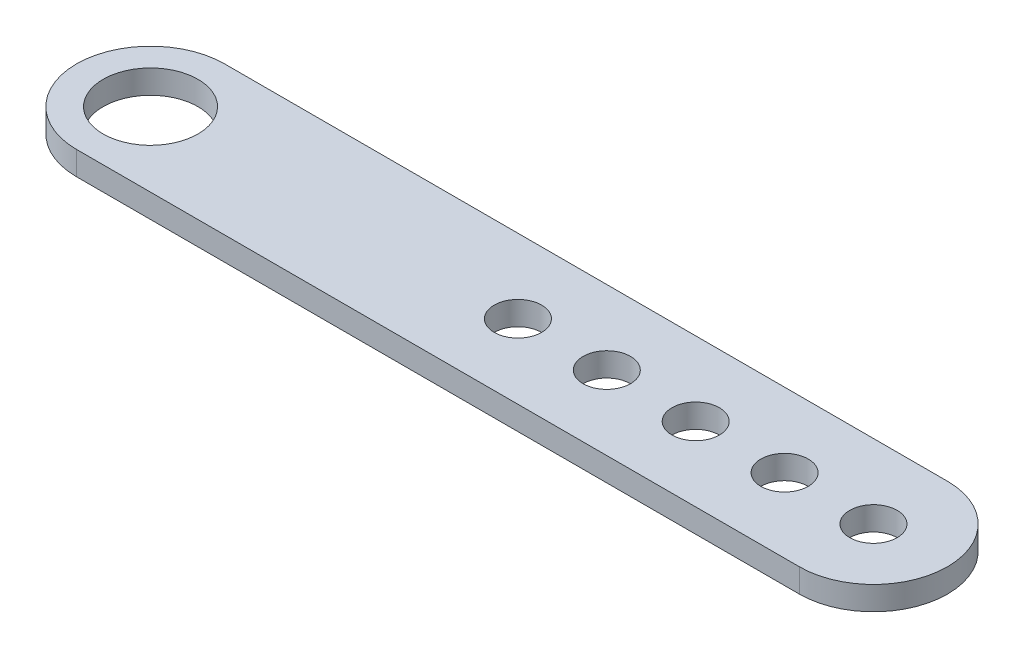
ISO-10303-21;
HEADER;
FILE_DESCRIPTION(('STEP AP214'),'2;1');
FILE_NAME('part.step','',(''),(''),'','','');
FILE_SCHEMA(('AUTOMOTIVE_DESIGN { 1 0 10303 214 1 1 1 1 }'));
ENDSEC;
DATA;
#1=APPLICATION_CONTEXT('core data for automotive mechanical design processes');
#2=APPLICATION_PROTOCOL_DEFINITION('international standard','automotive_design',2000,#1);
#3=PRODUCT_CONTEXT('',#1,'mechanical');
#4=PRODUCT('Part','Part','',(#3));
#5=PRODUCT_RELATED_PRODUCT_CATEGORY('part','',(#4));
#6=PRODUCT_DEFINITION_FORMATION('','',#4);
#7=PRODUCT_DEFINITION_CONTEXT('part definition',#1,'design');
#8=PRODUCT_DEFINITION('design','',#6,#7);
#9=PRODUCT_DEFINITION_SHAPE('','',#8);
#10=(LENGTH_UNIT() NAMED_UNIT(*) SI_UNIT(.MILLI.,.METRE.));
#11=(NAMED_UNIT(*) PLANE_ANGLE_UNIT() SI_UNIT($,.RADIAN.));
#12=(NAMED_UNIT(*) SI_UNIT($,.STERADIAN.) SOLID_ANGLE_UNIT());
#13=UNCERTAINTY_MEASURE_WITH_UNIT(LENGTH_MEASURE(1.E-05),#10,'distance_accuracy_value','');
#14=(GEOMETRIC_REPRESENTATION_CONTEXT(3) GLOBAL_UNCERTAINTY_ASSIGNED_CONTEXT((#13)) GLOBAL_UNIT_ASSIGNED_CONTEXT((#10,
#11,#12)) REPRESENTATION_CONTEXT('',''));
#15=CARTESIAN_POINT('',(0.,0.,0.));
#16=DIRECTION('',(0.,0.,1.));
#17=DIRECTION('',(1.,0.,0.));
#18=AXIS2_PLACEMENT_3D('',#15,#16,#17);
#19=CARTESIAN_POINT('',(-61.,2.,0.));
#20=DIRECTION('',(0.,1.,0.));
#21=DIRECTION('',(0.,0.,1.));
#22=AXIS2_PLACEMENT_3D('',#19,#20,#21);
#23=PLANE('',#22);
#24=CARTESIAN_POINT('',(46.,2.,0.));
#25=DIRECTION('',(0.,1.,0.));
#26=DIRECTION('',(0.,0.,1.));
#27=AXIS2_PLACEMENT_3D('',#24,#25,#26);
#28=CIRCLE('',#27,4.);
#29=CARTESIAN_POINT('',(46.,2.,4.));
#30=VERTEX_POINT('',#29);
#31=EDGE_CURVE('E139',#30,#30,#28,.T.);
#32=ORIENTED_EDGE('',*,*,#31,.F.);
#33=EDGE_LOOP('',(#32));
#34=FACE_BOUND('',#33,.T.);
#35=CARTESIAN_POINT('',(16.,2.,0.));
#36=DIRECTION('',(0.,1.,0.));
#37=DIRECTION('',(0.,0.,1.));
#38=AXIS2_PLACEMENT_3D('',#35,#36,#37);
#39=CIRCLE('',#38,4.);
#40=CARTESIAN_POINT('',(16.,2.,4.));
#41=VERTEX_POINT('',#40);
#42=EDGE_CURVE('E127',#41,#41,#39,.T.);
#43=ORIENTED_EDGE('',*,*,#42,.F.);
#44=EDGE_LOOP('',(#43));
#45=FACE_BOUND('',#44,.T.);
#46=CARTESIAN_POINT('',(-61.,2.,0.));
#47=DIRECTION('',(0.,1.,0.));
#48=DIRECTION('',(0.,0.,1.));
#49=AXIS2_PLACEMENT_3D('',#46,#47,#48);
#50=CIRCLE('',#49,8.);
#51=CARTESIAN_POINT('',(-61.,2.,8.));
#52=VERTEX_POINT('',#51);
#53=EDGE_CURVE('E106',#52,#52,#50,.T.);
#54=ORIENTED_EDGE('',*,*,#53,.F.);
#55=EDGE_LOOP('',(#54));
#56=FACE_BOUND('',#55,.T.);
#57=CARTESIAN_POINT('',(-61.,2.,0.));
#58=DIRECTION('',(0.,1.,0.));
#59=DIRECTION('',(0.,0.,1.));
#60=AXIS2_PLACEMENT_3D('',#57,#58,#59);
#61=CIRCLE('',#60,12.5);
#62=CARTESIAN_POINT('',(-61.,2.,-12.5));
#63=VERTEX_POINT('',#62);
#64=CARTESIAN_POINT('',(-61.,2.,12.5));
#65=VERTEX_POINT('',#64);
#66=EDGE_CURVE('E91',#63,#65,#61,.T.);
#67=ORIENTED_EDGE('',*,*,#66,.T.);
#68=DIRECTION('',(1.,0.,0.));
#69=VECTOR('',#68,1.);
#70=CARTESIAN_POINT('',(-61.,2.,12.5));
#71=LINE('',#70,#69);
#72=CARTESIAN_POINT('',(61.,2.,12.5));
#73=VERTEX_POINT('',#72);
#74=EDGE_CURVE('E86',#65,#73,#71,.T.);
#75=ORIENTED_EDGE('',*,*,#74,.T.);
#76=CARTESIAN_POINT('',(61.,2.,0.));
#77=DIRECTION('',(0.,1.,0.));
#78=DIRECTION('',(0.,0.,1.));
#79=AXIS2_PLACEMENT_3D('',#76,#77,#78);
#80=CIRCLE('',#79,12.5);
#81=CARTESIAN_POINT('',(61.,2.,-12.5));
#82=VERTEX_POINT('',#81);
#83=EDGE_CURVE('E89',#73,#82,#80,.T.);
#84=ORIENTED_EDGE('',*,*,#83,.T.);
#85=DIRECTION('',(-1.,0.,0.));
#86=VECTOR('',#85,1.);
#87=CARTESIAN_POINT('',(-61.,2.,-12.5));
#88=LINE('',#87,#86);
#89=EDGE_CURVE('E56',#82,#63,#88,.T.);
#90=ORIENTED_EDGE('',*,*,#89,.T.);
#91=EDGE_LOOP('',(#67,#75,#84,#90));
#92=FACE_BOUND('',#91,.T.);
#93=CARTESIAN_POINT('',(1.,2.,0.));
#94=DIRECTION('',(0.,1.,0.));
#95=DIRECTION('',(0.,0.,1.));
#96=AXIS2_PLACEMENT_3D('',#93,#94,#95);
#97=CIRCLE('',#96,4.);
#98=CARTESIAN_POINT('',(1.,2.,4.));
#99=VERTEX_POINT('',#98);
#100=EDGE_CURVE('E121',#99,#99,#97,.T.);
#101=ORIENTED_EDGE('',*,*,#100,.F.);
#102=EDGE_LOOP('',(#101));
#103=FACE_BOUND('',#102,.T.);
#104=CARTESIAN_POINT('',(31.,2.,0.));
#105=DIRECTION('',(0.,1.,0.));
#106=DIRECTION('',(0.,0.,1.));
#107=AXIS2_PLACEMENT_3D('',#104,#105,#106);
#108=CIRCLE('',#107,4.);
#109=CARTESIAN_POINT('',(31.,2.,4.));
#110=VERTEX_POINT('',#109);
#111=EDGE_CURVE('E133',#110,#110,#108,.T.);
#112=ORIENTED_EDGE('',*,*,#111,.F.);
#113=EDGE_LOOP('',(#112));
#114=FACE_BOUND('',#113,.T.);
#115=CARTESIAN_POINT('',(61.,2.,0.));
#116=DIRECTION('',(0.,1.,0.));
#117=DIRECTION('',(0.,0.,1.));
#118=AXIS2_PLACEMENT_3D('',#115,#116,#117);
#119=CIRCLE('',#118,4.00000000000001);
#120=CARTESIAN_POINT('',(61.,2.,4.00000000000001));
#121=VERTEX_POINT('',#120);
#122=EDGE_CURVE('E145',#121,#121,#119,.T.);
#123=ORIENTED_EDGE('',*,*,#122,.F.);
#124=EDGE_LOOP('',(#123));
#125=FACE_BOUND('',#124,.T.);
#126=ADVANCED_FACE('F39',(#34,#45,#56,#92,#103,#114,#125),#23,.T.);
#127=CARTESIAN_POINT('',(-61.,-2.,0.));
#128=DIRECTION('',(0.,1.,0.));
#129=DIRECTION('',(0.,0.,1.));
#130=AXIS2_PLACEMENT_3D('',#127,#128,#129);
#131=PLANE('',#130);
#132=CARTESIAN_POINT('',(-61.,-2.,0.));
#133=DIRECTION('',(0.,1.,0.));
#134=DIRECTION('',(0.,0.,1.));
#135=AXIS2_PLACEMENT_3D('',#132,#133,#134);
#136=CIRCLE('',#135,12.5);
#137=CARTESIAN_POINT('',(-61.,-2.,-12.5));
#138=VERTEX_POINT('',#137);
#139=CARTESIAN_POINT('',(-61.,-2.,12.5));
#140=VERTEX_POINT('',#139);
#141=EDGE_CURVE('E103',#138,#140,#136,.T.);
#142=ORIENTED_EDGE('',*,*,#141,.F.);
#143=DIRECTION('',(-1.,0.,0.));
#144=VECTOR('',#143,1.);
#145=CARTESIAN_POINT('',(-61.,-2.,-12.5));
#146=LINE('',#145,#144);
#147=CARTESIAN_POINT('',(61.,-2.,-12.5));
#148=VERTEX_POINT('',#147);
#149=EDGE_CURVE('E79',#148,#138,#146,.T.);
#150=ORIENTED_EDGE('',*,*,#149,.F.);
#151=CARTESIAN_POINT('',(61.,-2.,0.));
#152=DIRECTION('',(0.,1.,0.));
#153=DIRECTION('',(0.,0.,1.));
#154=AXIS2_PLACEMENT_3D('',#151,#152,#153);
#155=CIRCLE('',#154,12.5);
#156=CARTESIAN_POINT('',(61.,-2.,12.5));
#157=VERTEX_POINT('',#156);
#158=EDGE_CURVE('E73',#157,#148,#155,.T.);
#159=ORIENTED_EDGE('',*,*,#158,.F.);
#160=DIRECTION('',(1.,0.,0.));
#161=VECTOR('',#160,1.);
#162=CARTESIAN_POINT('',(-61.,-2.,12.5));
#163=LINE('',#162,#161);
#164=EDGE_CURVE('E95',#140,#157,#163,.T.);
#165=ORIENTED_EDGE('',*,*,#164,.F.);
#166=EDGE_LOOP('',(#142,#150,#159,#165));
#167=FACE_BOUND('',#166,.T.);
#168=CARTESIAN_POINT('',(-61.,-2.,0.));
#169=DIRECTION('',(0.,1.,0.));
#170=DIRECTION('',(0.,0.,1.));
#171=AXIS2_PLACEMENT_3D('',#168,#169,#170);
#172=CIRCLE('',#171,8.);
#173=CARTESIAN_POINT('',(-61.,-2.,8.));
#174=VERTEX_POINT('',#173);
#175=EDGE_CURVE('E118',#174,#174,#172,.T.);
#176=ORIENTED_EDGE('',*,*,#175,.T.);
#177=EDGE_LOOP('',(#176));
#178=FACE_BOUND('',#177,.T.);
#179=CARTESIAN_POINT('',(1.,-2.,0.));
#180=DIRECTION('',(0.,1.,0.));
#181=DIRECTION('',(0.,0.,1.));
#182=AXIS2_PLACEMENT_3D('',#179,#180,#181);
#183=CIRCLE('',#182,4.);
#184=CARTESIAN_POINT('',(1.,-2.,4.));
#185=VERTEX_POINT('',#184);
#186=EDGE_CURVE('E124',#185,#185,#183,.T.);
#187=ORIENTED_EDGE('',*,*,#186,.T.);
#188=EDGE_LOOP('',(#187));
#189=FACE_BOUND('',#188,.T.);
#190=CARTESIAN_POINT('',(16.,-2.,0.));
#191=DIRECTION('',(0.,1.,0.));
#192=DIRECTION('',(0.,0.,1.));
#193=AXIS2_PLACEMENT_3D('',#190,#191,#192);
#194=CIRCLE('',#193,4.);
#195=CARTESIAN_POINT('',(16.,-2.,4.));
#196=VERTEX_POINT('',#195);
#197=EDGE_CURVE('E130',#196,#196,#194,.T.);
#198=ORIENTED_EDGE('',*,*,#197,.T.);
#199=EDGE_LOOP('',(#198));
#200=FACE_BOUND('',#199,.T.);
#201=CARTESIAN_POINT('',(31.,-2.,0.));
#202=DIRECTION('',(0.,1.,0.));
#203=DIRECTION('',(0.,0.,1.));
#204=AXIS2_PLACEMENT_3D('',#201,#202,#203);
#205=CIRCLE('',#204,4.);
#206=CARTESIAN_POINT('',(31.,-2.,4.));
#207=VERTEX_POINT('',#206);
#208=EDGE_CURVE('E136',#207,#207,#205,.T.);
#209=ORIENTED_EDGE('',*,*,#208,.T.);
#210=EDGE_LOOP('',(#209));
#211=FACE_BOUND('',#210,.T.);
#212=CARTESIAN_POINT('',(46.,-2.,0.));
#213=DIRECTION('',(0.,1.,0.));
#214=DIRECTION('',(0.,0.,1.));
#215=AXIS2_PLACEMENT_3D('',#212,#213,#214);
#216=CIRCLE('',#215,4.);
#217=CARTESIAN_POINT('',(46.,-2.,4.));
#218=VERTEX_POINT('',#217);
#219=EDGE_CURVE('E142',#218,#218,#216,.T.);
#220=ORIENTED_EDGE('',*,*,#219,.T.);
#221=EDGE_LOOP('',(#220));
#222=FACE_BOUND('',#221,.T.);
#223=CARTESIAN_POINT('',(61.,-2.,0.));
#224=DIRECTION('',(0.,1.,0.));
#225=DIRECTION('',(0.,0.,1.));
#226=AXIS2_PLACEMENT_3D('',#223,#224,#225);
#227=CIRCLE('',#226,4.00000000000001);
#228=CARTESIAN_POINT('',(61.,-2.,4.00000000000001));
#229=VERTEX_POINT('',#228);
#230=EDGE_CURVE('E148',#229,#229,#227,.T.);
#231=ORIENTED_EDGE('',*,*,#230,.T.);
#232=EDGE_LOOP('',(#231));
#233=FACE_BOUND('',#232,.T.);
#234=ADVANCED_FACE('F114',(#167,#178,#189,#200,#211,#222,#233),#131,.F.);
#235=CARTESIAN_POINT('',(-61.,2.,0.));
#236=DIRECTION('',(0.,-1.,0.));
#237=DIRECTION('',(0.,0.,-1.));
#238=AXIS2_PLACEMENT_3D('',#235,#236,#237);
#239=CYLINDRICAL_SURFACE('',#238,12.5);
#240=ORIENTED_EDGE('',*,*,#141,.T.);
#241=DIRECTION('',(0.,-1.,0.));
#242=VECTOR('',#241,1.);
#243=CARTESIAN_POINT('',(-61.,2.,12.5));
#244=LINE('',#243,#242);
#245=EDGE_CURVE('E11',#65,#140,#244,.T.);
#246=ORIENTED_EDGE('',*,*,#245,.F.);
#247=ORIENTED_EDGE('',*,*,#66,.F.);
#248=DIRECTION('',(0.,-1.,0.));
#249=VECTOR('',#248,1.);
#250=CARTESIAN_POINT('',(-61.,2.,-12.5));
#251=LINE('',#250,#249);
#252=EDGE_CURVE('E99',#63,#138,#251,.T.);
#253=ORIENTED_EDGE('',*,*,#252,.T.);
#254=EDGE_LOOP('',(#240,#246,#247,#253));
#255=FACE_BOUND('',#254,.T.);
#256=ADVANCED_FACE('F41',(#255),#239,.T.);
#257=CARTESIAN_POINT('',(-61.,2.,12.5));
#258=DIRECTION('',(0.,0.,-1.));
#259=DIRECTION('',(-1.,0.,0.));
#260=AXIS2_PLACEMENT_3D('',#257,#258,#259);
#261=PLANE('',#260);
#262=ORIENTED_EDGE('',*,*,#164,.T.);
#263=DIRECTION('',(0.,-1.,0.));
#264=VECTOR('',#263,1.);
#265=CARTESIAN_POINT('',(61.,2.,12.5));
#266=LINE('',#265,#264);
#267=EDGE_CURVE('E48',#73,#157,#266,.T.);
#268=ORIENTED_EDGE('',*,*,#267,.F.);
#269=ORIENTED_EDGE('',*,*,#74,.F.);
#270=ORIENTED_EDGE('',*,*,#245,.T.);
#271=EDGE_LOOP('',(#262,#268,#269,#270));
#272=FACE_BOUND('',#271,.T.);
#273=ADVANCED_FACE('F94',(#272),#261,.F.);
#274=CARTESIAN_POINT('',(61.,2.,0.));
#275=DIRECTION('',(0.,-1.,0.));
#276=DIRECTION('',(0.,0.,-1.));
#277=AXIS2_PLACEMENT_3D('',#274,#275,#276);
#278=CYLINDRICAL_SURFACE('',#277,12.5);
#279=ORIENTED_EDGE('',*,*,#158,.T.);
#280=DIRECTION('',(0.,-1.,0.));
#281=VECTOR('',#280,1.);
#282=CARTESIAN_POINT('',(61.,2.,-12.5));
#283=LINE('',#282,#281);
#284=EDGE_CURVE('E96',#82,#148,#283,.T.);
#285=ORIENTED_EDGE('',*,*,#284,.F.);
#286=ORIENTED_EDGE('',*,*,#83,.F.);
#287=ORIENTED_EDGE('',*,*,#267,.T.);
#288=EDGE_LOOP('',(#279,#285,#286,#287));
#289=FACE_BOUND('',#288,.T.);
#290=ADVANCED_FACE('F97',(#289),#278,.T.);
#291=CARTESIAN_POINT('',(-61.,2.,-12.5));
#292=DIRECTION('',(0.,0.,1.));
#293=DIRECTION('',(1.,0.,0.));
#294=AXIS2_PLACEMENT_3D('',#291,#292,#293);
#295=PLANE('',#294);
#296=ORIENTED_EDGE('',*,*,#149,.T.);
#297=ORIENTED_EDGE('',*,*,#252,.F.);
#298=ORIENTED_EDGE('',*,*,#89,.F.);
#299=ORIENTED_EDGE('',*,*,#284,.T.);
#300=EDGE_LOOP('',(#296,#297,#298,#299));
#301=FACE_BOUND('',#300,.T.);
#302=ADVANCED_FACE('F111',(#301),#295,.F.);
#303=CARTESIAN_POINT('',(-61.,2.,0.));
#304=DIRECTION('',(0.,-1.,0.));
#305=DIRECTION('',(0.,0.,-1.));
#306=AXIS2_PLACEMENT_3D('',#303,#304,#305);
#307=CYLINDRICAL_SURFACE('',#306,8.);
#308=ORIENTED_EDGE('',*,*,#53,.T.);
#309=EDGE_LOOP('',(#308));
#310=FACE_BOUND('',#309,.T.);
#311=ORIENTED_EDGE('',*,*,#175,.F.);
#312=EDGE_LOOP('',(#311));
#313=FACE_BOUND('',#312,.T.);
#314=ADVANCED_FACE('F167',(#310,#313),#307,.F.);
#315=CARTESIAN_POINT('',(1.,2.,0.));
#316=DIRECTION('',(0.,-1.,0.));
#317=DIRECTION('',(0.,0.,-1.));
#318=AXIS2_PLACEMENT_3D('',#315,#316,#317);
#319=CYLINDRICAL_SURFACE('',#318,4.);
#320=ORIENTED_EDGE('',*,*,#100,.T.);
#321=EDGE_LOOP('',(#320));
#322=FACE_BOUND('',#321,.T.);
#323=ORIENTED_EDGE('',*,*,#186,.F.);
#324=EDGE_LOOP('',(#323));
#325=FACE_BOUND('',#324,.T.);
#326=ADVANCED_FACE('F202',(#322,#325),#319,.F.);
#327=CARTESIAN_POINT('',(16.,2.,0.));
#328=DIRECTION('',(0.,-1.,0.));
#329=DIRECTION('',(0.,0.,-1.));
#330=AXIS2_PLACEMENT_3D('',#327,#328,#329);
#331=CYLINDRICAL_SURFACE('',#330,4.);
#332=ORIENTED_EDGE('',*,*,#42,.T.);
#333=EDGE_LOOP('',(#332));
#334=FACE_BOUND('',#333,.T.);
#335=ORIENTED_EDGE('',*,*,#197,.F.);
#336=EDGE_LOOP('',(#335));
#337=FACE_BOUND('',#336,.T.);
#338=ADVANCED_FACE('F209',(#334,#337),#331,.F.);
#339=CARTESIAN_POINT('',(31.,2.,0.));
#340=DIRECTION('',(0.,-1.,0.));
#341=DIRECTION('',(0.,0.,-1.));
#342=AXIS2_PLACEMENT_3D('',#339,#340,#341);
#343=CYLINDRICAL_SURFACE('',#342,4.);
#344=ORIENTED_EDGE('',*,*,#111,.T.);
#345=EDGE_LOOP('',(#344));
#346=FACE_BOUND('',#345,.T.);
#347=ORIENTED_EDGE('',*,*,#208,.F.);
#348=EDGE_LOOP('',(#347));
#349=FACE_BOUND('',#348,.T.);
#350=ADVANCED_FACE('F216',(#346,#349),#343,.F.);
#351=CARTESIAN_POINT('',(46.,2.,0.));
#352=DIRECTION('',(0.,-1.,0.));
#353=DIRECTION('',(0.,0.,-1.));
#354=AXIS2_PLACEMENT_3D('',#351,#352,#353);
#355=CYLINDRICAL_SURFACE('',#354,4.);
#356=ORIENTED_EDGE('',*,*,#31,.T.);
#357=EDGE_LOOP('',(#356));
#358=FACE_BOUND('',#357,.T.);
#359=ORIENTED_EDGE('',*,*,#219,.F.);
#360=EDGE_LOOP('',(#359));
#361=FACE_BOUND('',#360,.T.);
#362=ADVANCED_FACE('F224',(#358,#361),#355,.F.);
#363=CARTESIAN_POINT('',(61.,2.,0.));
#364=DIRECTION('',(0.,-1.,0.));
#365=DIRECTION('',(0.,0.,-1.));
#366=AXIS2_PLACEMENT_3D('',#363,#364,#365);
#367=CYLINDRICAL_SURFACE('',#366,4.00000000000001);
#368=ORIENTED_EDGE('',*,*,#122,.T.);
#369=EDGE_LOOP('',(#368));
#370=FACE_BOUND('',#369,.T.);
#371=ORIENTED_EDGE('',*,*,#230,.F.);
#372=EDGE_LOOP('',(#371));
#373=FACE_BOUND('',#372,.T.);
#374=ADVANCED_FACE('F154',(#370,#373),#367,.F.);
#375=CLOSED_SHELL('',(#126,#234,#256,#273,#290,#302,#314,#326,#338,#350,#362,#374));
#376=MANIFOLD_SOLID_BREP('B2',#375);
#377=ADVANCED_BREP_SHAPE_REPRESENTATION('',(#18,#376),#14);
#378=SHAPE_DEFINITION_REPRESENTATION(#9,#377);
ENDSEC;
END-ISO-10303-21;
